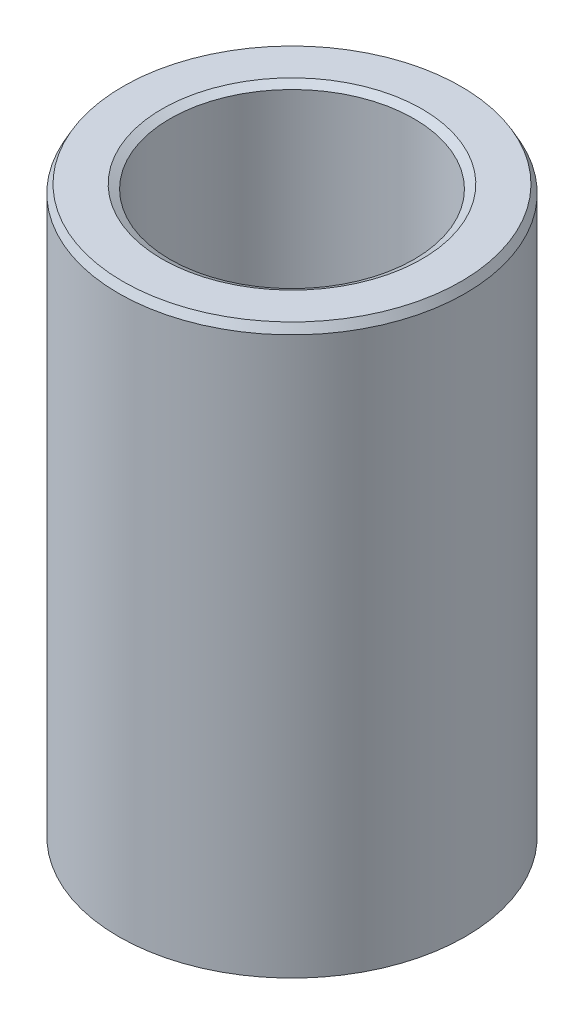
ISO-10303-21;
HEADER;
FILE_DESCRIPTION(('STEP AP214'),'2;1');
FILE_NAME('part.step','',(''),(''),'','','');
FILE_SCHEMA(('AUTOMOTIVE_DESIGN { 1 0 10303 214 1 1 1 1 }'));
ENDSEC;
DATA;
#1=APPLICATION_CONTEXT('core data for automotive mechanical design processes');
#2=APPLICATION_PROTOCOL_DEFINITION('international standard','automotive_design',2000,#1);
#3=PRODUCT_CONTEXT('',#1,'mechanical');
#4=PRODUCT('Part','Part','',(#3));
#5=PRODUCT_RELATED_PRODUCT_CATEGORY('part','',(#4));
#6=PRODUCT_DEFINITION_FORMATION('','',#4);
#7=PRODUCT_DEFINITION_CONTEXT('part definition',#1,'design');
#8=PRODUCT_DEFINITION('design','',#6,#7);
#9=PRODUCT_DEFINITION_SHAPE('','',#8);
#10=(LENGTH_UNIT() NAMED_UNIT(*) SI_UNIT(.MILLI.,.METRE.));
#11=(NAMED_UNIT(*) PLANE_ANGLE_UNIT() SI_UNIT($,.RADIAN.));
#12=(NAMED_UNIT(*) SI_UNIT($,.STERADIAN.) SOLID_ANGLE_UNIT());
#13=UNCERTAINTY_MEASURE_WITH_UNIT(LENGTH_MEASURE(1.E-05),#10,'distance_accuracy_value','');
#14=(GEOMETRIC_REPRESENTATION_CONTEXT(3) GLOBAL_UNCERTAINTY_ASSIGNED_CONTEXT((#13)) GLOBAL_UNIT_ASSIGNED_CONTEXT((#10,
#11,#12)) REPRESENTATION_CONTEXT('',''));
#15=CARTESIAN_POINT('',(0.,0.,0.));
#16=DIRECTION('',(0.,0.,1.));
#17=DIRECTION('',(1.,0.,0.));
#18=AXIS2_PLACEMENT_3D('',#15,#16,#17);
#19=CARTESIAN_POINT('',(0.,131.3807164406,0.));
#20=DIRECTION('',(0.,-1.,0.));
#21=DIRECTION('',(0.,0.,-1.));
#22=AXIS2_PLACEMENT_3D('',#19,#20,#21);
#23=CYLINDRICAL_SURFACE('',#22,40.);
#24=CARTESIAN_POINT('',(0.,1.01135700890875,0.));
#25=DIRECTION('',(0.,1.,0.));
#26=DIRECTION('',(0.,0.,1.));
#27=AXIS2_PLACEMENT_3D('',#24,#25,#26);
#28=CIRCLE('',#27,40.);
#29=CARTESIAN_POINT('',(0.,1.01135700890875,40.));
#30=VERTEX_POINT('',#29);
#31=EDGE_CURVE('E10',#30,#30,#28,.T.);
#32=ORIENTED_EDGE('',*,*,#31,.T.);
#33=EDGE_LOOP('',(#32));
#34=FACE_BOUND('',#33,.T.);
#35=CARTESIAN_POINT('',(0.,129.52321628946,0.));
#36=DIRECTION('',(0.,1.,0.));
#37=DIRECTION('',(0.,0.,1.));
#38=AXIS2_PLACEMENT_3D('',#35,#36,#37);
#39=CIRCLE('',#38,40.);
#40=CARTESIAN_POINT('',(0.,129.52321628946,40.));
#41=VERTEX_POINT('',#40);
#42=EDGE_CURVE('E50',#41,#41,#39,.F.);
#43=ORIENTED_EDGE('',*,*,#42,.T.);
#44=EDGE_LOOP('',(#43));
#45=FACE_BOUND('',#44,.T.);
#46=ADVANCED_FACE('F39',(#34,#45),#23,.T.);
#47=CARTESIAN_POINT('',(0.,131.3807164406,0.));
#48=DIRECTION('',(0.,1.,0.));
#49=DIRECTION('',(0.,0.,1.));
#50=AXIS2_PLACEMENT_3D('',#47,#48,#49);
#51=PLANE('',#50);
#52=CARTESIAN_POINT('',(0.,131.3807164406,0.));
#53=DIRECTION('',(0.,1.,0.));
#54=DIRECTION('',(0.,0.,1.));
#55=AXIS2_PLACEMENT_3D('',#52,#53,#54);
#56=CIRCLE('',#55,29.9905443124265);
#57=CARTESIAN_POINT('',(0.,131.3807164406,29.9905443124265));
#58=VERTEX_POINT('',#57);
#59=EDGE_CURVE('E58',#58,#58,#56,.F.);
#60=ORIENTED_EDGE('',*,*,#59,.T.);
#61=EDGE_LOOP('',(#60));
#62=FACE_BOUND('',#61,.T.);
#63=CARTESIAN_POINT('',(0.,131.3807164406,0.));
#64=DIRECTION('',(0.,1.,0.));
#65=DIRECTION('',(0.,0.,1.));
#66=AXIS2_PLACEMENT_3D('',#63,#64,#65);
#67=CIRCLE('',#66,38.9886429910912);
#68=CARTESIAN_POINT('',(0.,131.3807164406,38.9886429910912));
#69=VERTEX_POINT('',#68);
#70=EDGE_CURVE('E61',#69,#69,#67,.T.);
#71=ORIENTED_EDGE('',*,*,#70,.T.);
#72=EDGE_LOOP('',(#71));
#73=FACE_BOUND('',#72,.T.);
#74=ADVANCED_FACE('F88',(#62,#73),#51,.T.);
#75=CARTESIAN_POINT('',(0.,0.,0.));
#76=DIRECTION('',(0.,1.,0.));
#77=DIRECTION('',(0.,0.,1.));
#78=AXIS2_PLACEMENT_3D('',#75,#76,#77);
#79=PLANE('',#78);
#80=CARTESIAN_POINT('',(0.,0.,0.));
#81=DIRECTION('',(0.,1.,0.));
#82=DIRECTION('',(0.,0.,1.));
#83=AXIS2_PLACEMENT_3D('',#80,#81,#82);
#84=CIRCLE('',#83,29.144401170195);
#85=CARTESIAN_POINT('',(0.,0.,29.144401170195));
#86=VERTEX_POINT('',#85);
#87=EDGE_CURVE('E51',#86,#86,#84,.T.);
#88=ORIENTED_EDGE('',*,*,#87,.T.);
#89=EDGE_LOOP('',(#88));
#90=FACE_BOUND('',#89,.T.);
#91=CARTESIAN_POINT('',(0.,0.,0.));
#92=DIRECTION('',(0.,1.,0.));
#93=DIRECTION('',(0.,0.,1.));
#94=AXIS2_PLACEMENT_3D('',#91,#92,#93);
#95=CIRCLE('',#94,38.1424998488598);
#96=CARTESIAN_POINT('',(0.,0.,38.1424998488598));
#97=VERTEX_POINT('',#96);
#98=EDGE_CURVE('E54',#97,#97,#95,.F.);
#99=ORIENTED_EDGE('',*,*,#98,.T.);
#100=EDGE_LOOP('',(#99));
#101=FACE_BOUND('',#100,.T.);
#102=ADVANCED_FACE('F83',(#90,#101),#79,.F.);
#103=CARTESIAN_POINT('',(0.,131.3807164406,0.));
#104=DIRECTION('',(0.,-1.,0.));
#105=DIRECTION('',(0.,0.,-1.));
#106=AXIS2_PLACEMENT_3D('',#103,#104,#105);
#107=CYLINDRICAL_SURFACE('',#106,28.1330441612862);
#108=CARTESIAN_POINT('',(0.,130.369359431691,0.));
#109=DIRECTION('',(0.,1.,0.));
#110=DIRECTION('',(0.,0.,1.));
#111=AXIS2_PLACEMENT_3D('',#108,#109,#110);
#112=CIRCLE('',#111,28.1330441612862);
#113=CARTESIAN_POINT('',(0.,130.369359431691,28.1330441612862));
#114=VERTEX_POINT('',#113);
#115=EDGE_CURVE('E67',#114,#114,#112,.T.);
#116=ORIENTED_EDGE('',*,*,#115,.T.);
#117=EDGE_LOOP('',(#116));
#118=FACE_BOUND('',#117,.T.);
#119=CARTESIAN_POINT('',(0.,1.85750015114025,0.));
#120=DIRECTION('',(0.,1.,0.));
#121=DIRECTION('',(0.,0.,1.));
#122=AXIS2_PLACEMENT_3D('',#119,#120,#121);
#123=CIRCLE('',#122,28.1330441612862);
#124=CARTESIAN_POINT('',(0.,1.85750015114025,28.1330441612862));
#125=VERTEX_POINT('',#124);
#126=EDGE_CURVE('E69',#125,#125,#123,.F.);
#127=ORIENTED_EDGE('',*,*,#126,.T.);
#128=EDGE_LOOP('',(#127));
#129=FACE_BOUND('',#128,.T.);
#130=ADVANCED_FACE('F71',(#118,#129),#107,.F.);
#131=CARTESIAN_POINT('',(0.,130.369359431691,0.));
#132=DIRECTION('',(0.,1.,0.));
#133=DIRECTION('',(0.,0.,1.));
#134=AXIS2_PLACEMENT_3D('',#131,#132,#133);
#135=CONICAL_SURFACE('',#134,28.1330441612862,1.07220708879028);
#136=ORIENTED_EDGE('',*,*,#59,.F.);
#137=EDGE_LOOP('',(#136));
#138=FACE_BOUND('',#137,.T.);
#139=ORIENTED_EDGE('',*,*,#115,.F.);
#140=EDGE_LOOP('',(#139));
#141=FACE_BOUND('',#140,.T.);
#142=ADVANCED_FACE('F77',(#138,#141),#135,.F.);
#143=CARTESIAN_POINT('',(0.,0.,0.));
#144=DIRECTION('',(0.,-1.,0.));
#145=DIRECTION('',(0.,0.,-1.));
#146=AXIS2_PLACEMENT_3D('',#143,#144,#145);
#147=CONICAL_SURFACE('',#146,29.144401170195,0.498589238004612);
#148=ORIENTED_EDGE('',*,*,#126,.F.);
#149=EDGE_LOOP('',(#148));
#150=FACE_BOUND('',#149,.T.);
#151=ORIENTED_EDGE('',*,*,#87,.F.);
#152=EDGE_LOOP('',(#151));
#153=FACE_BOUND('',#152,.T.);
#154=ADVANCED_FACE('F73',(#150,#153),#147,.F.);
#155=CARTESIAN_POINT('',(0.,1.01135700890875,0.));
#156=DIRECTION('',(0.,1.,0.));
#157=DIRECTION('',(0.,0.,1.));
#158=AXIS2_PLACEMENT_3D('',#155,#156,#157);
#159=CONICAL_SURFACE('',#158,40.,1.07220708879029);
#160=ORIENTED_EDGE('',*,*,#98,.F.);
#161=EDGE_LOOP('',(#160));
#162=FACE_BOUND('',#161,.T.);
#163=ORIENTED_EDGE('',*,*,#31,.F.);
#164=EDGE_LOOP('',(#163));
#165=FACE_BOUND('',#164,.T.);
#166=ADVANCED_FACE('F76',(#162,#165),#159,.T.);
#167=CARTESIAN_POINT('',(0.,131.3807164406,0.));
#168=DIRECTION('',(0.,-1.,0.));
#169=DIRECTION('',(0.,0.,-1.));
#170=AXIS2_PLACEMENT_3D('',#167,#168,#169);
#171=CONICAL_SURFACE('',#170,38.9886429910912,0.498589238004614);
#172=ORIENTED_EDGE('',*,*,#42,.F.);
#173=EDGE_LOOP('',(#172));
#174=FACE_BOUND('',#173,.T.);
#175=ORIENTED_EDGE('',*,*,#70,.F.);
#176=EDGE_LOOP('',(#175));
#177=FACE_BOUND('',#176,.T.);
#178=ADVANCED_FACE('F45',(#174,#177),#171,.T.);
#179=CLOSED_SHELL('',(#46,#74,#102,#130,#142,#154,#166,#178));
#180=MANIFOLD_SOLID_BREP('B2',#179);
#181=ADVANCED_BREP_SHAPE_REPRESENTATION('',(#18,#180),#14);
#182=SHAPE_DEFINITION_REPRESENTATION(#9,#181);
ENDSEC;
END-ISO-10303-21;
